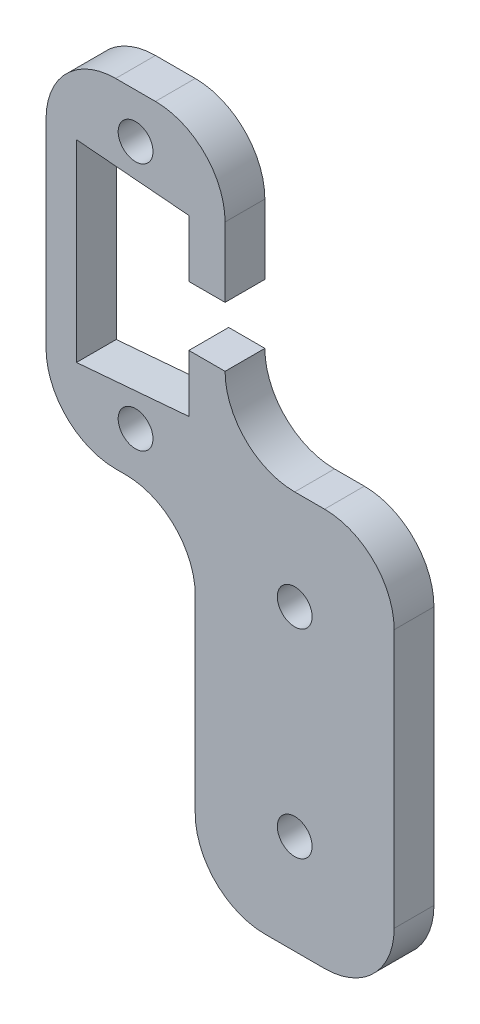
ISO-10303-21;
HEADER;
FILE_DESCRIPTION(('STEP AP214'),'2;1');
FILE_NAME('part.step','',(''),(''),'','','');
FILE_SCHEMA(('AUTOMOTIVE_DESIGN { 1 0 10303 214 1 1 1 1 }'));
ENDSEC;
DATA;
#1=APPLICATION_CONTEXT('core data for automotive mechanical design processes');
#2=APPLICATION_PROTOCOL_DEFINITION('international standard','automotive_design',2000,#1);
#3=PRODUCT_CONTEXT('',#1,'mechanical');
#4=PRODUCT('Part','Part','',(#3));
#5=PRODUCT_RELATED_PRODUCT_CATEGORY('part','',(#4));
#6=PRODUCT_DEFINITION_FORMATION('','',#4);
#7=PRODUCT_DEFINITION_CONTEXT('part definition',#1,'design');
#8=PRODUCT_DEFINITION('design','',#6,#7);
#9=PRODUCT_DEFINITION_SHAPE('','',#8);
#10=(LENGTH_UNIT() NAMED_UNIT(*) SI_UNIT(.MILLI.,.METRE.));
#11=(NAMED_UNIT(*) PLANE_ANGLE_UNIT() SI_UNIT($,.RADIAN.));
#12=(NAMED_UNIT(*) SI_UNIT($,.STERADIAN.) SOLID_ANGLE_UNIT());
#13=UNCERTAINTY_MEASURE_WITH_UNIT(LENGTH_MEASURE(1.E-05),#10,'distance_accuracy_value','');
#14=(GEOMETRIC_REPRESENTATION_CONTEXT(3) GLOBAL_UNCERTAINTY_ASSIGNED_CONTEXT((#13)) GLOBAL_UNIT_ASSIGNED_CONTEXT((#10,
#11,#12)) REPRESENTATION_CONTEXT('',''));
#15=CARTESIAN_POINT('',(0.,0.,0.));
#16=DIRECTION('',(0.,0.,1.));
#17=DIRECTION('',(1.,0.,0.));
#18=AXIS2_PLACEMENT_3D('',#15,#16,#17);
#19=CARTESIAN_POINT('',(0.,0.,4.));
#20=DIRECTION('',(0.,0.,1.));
#21=DIRECTION('',(1.,0.,0.));
#22=AXIS2_PLACEMENT_3D('',#19,#20,#21);
#23=PLANE('',#22);
#24=CARTESIAN_POINT('',(0.,12.5,4.));
#25=DIRECTION('',(0.,0.,1.));
#26=DIRECTION('',(1.,0.,0.));
#27=AXIS2_PLACEMENT_3D('',#24,#25,#26);
#28=CIRCLE('',#27,1.75);
#29=CARTESIAN_POINT('',(1.75,12.5,4.));
#30=VERTEX_POINT('',#29);
#31=EDGE_CURVE('E722',#30,#30,#28,.T.);
#32=ORIENTED_EDGE('',*,*,#31,.F.);
#33=EDGE_LOOP('',(#32));
#34=FACE_BOUND('',#33,.T.);
#35=CARTESIAN_POINT('',(16.,-40.,4.));
#36=DIRECTION('',(0.,0.,1.));
#37=DIRECTION('',(1.,0.,0.));
#38=AXIS2_PLACEMENT_3D('',#35,#36,#37);
#39=CIRCLE('',#38,1.75);
#40=CARTESIAN_POINT('',(17.75,-40.,4.));
#41=VERTEX_POINT('',#40);
#42=EDGE_CURVE('E380',#41,#41,#39,.T.);
#43=ORIENTED_EDGE('',*,*,#42,.F.);
#44=EDGE_LOOP('',(#43));
#45=FACE_BOUND('',#44,.T.);
#46=DIRECTION('',(0.,1.,0.));
#47=VECTOR('',#46,1.);
#48=CARTESIAN_POINT('',(9.,3.,4.));
#49=LINE('',#48,#47);
#50=CARTESIAN_POINT('',(9.,3.,4.));
#51=VERTEX_POINT('',#50);
#52=CARTESIAN_POINT('',(9.,10.,4.));
#53=VERTEX_POINT('',#52);
#54=EDGE_CURVE('E369',#51,#53,#49,.T.);
#55=ORIENTED_EDGE('',*,*,#54,.T.);
#56=CARTESIAN_POINT('',(2.,10.,4.));
#57=DIRECTION('',(0.,0.,1.));
#58=DIRECTION('',(1.,0.,0.));
#59=AXIS2_PLACEMENT_3D('',#56,#57,#58);
#60=CIRCLE('',#59,7.);
#61=CARTESIAN_POINT('',(2.,17.,4.));
#62=VERTEX_POINT('',#61);
#63=EDGE_CURVE('E243',#53,#62,#60,.T.);
#64=ORIENTED_EDGE('',*,*,#63,.T.);
#65=DIRECTION('',(-1.,0.,0.));
#66=VECTOR('',#65,1.);
#67=CARTESIAN_POINT('',(-9.,17.,4.));
#68=LINE('',#67,#66);
#69=CARTESIAN_POINT('',(-2.,17.,4.));
#70=VERTEX_POINT('',#69);
#71=EDGE_CURVE('E371',#62,#70,#68,.T.);
#72=ORIENTED_EDGE('',*,*,#71,.T.);
#73=CARTESIAN_POINT('',(-2.,10.,4.));
#74=DIRECTION('',(0.,0.,1.));
#75=DIRECTION('',(1.,0.,0.));
#76=AXIS2_PLACEMENT_3D('',#73,#74,#75);
#77=CIRCLE('',#76,7.);
#78=CARTESIAN_POINT('',(-9.,10.,4.));
#79=VERTEX_POINT('',#78);
#80=EDGE_CURVE('E233',#70,#79,#77,.T.);
#81=ORIENTED_EDGE('',*,*,#80,.T.);
#82=DIRECTION('',(0.,-1.,0.));
#83=VECTOR('',#82,1.);
#84=CARTESIAN_POINT('',(-9.,17.,4.));
#85=LINE('',#84,#83);
#86=CARTESIAN_POINT('',(-9.,-10.,4.));
#87=VERTEX_POINT('',#86);
#88=EDGE_CURVE('E374',#79,#87,#85,.T.);
#89=ORIENTED_EDGE('',*,*,#88,.T.);
#90=CARTESIAN_POINT('',(-2.,-10.,4.));
#91=DIRECTION('',(0.,0.,1.));
#92=DIRECTION('',(1.,0.,0.));
#93=AXIS2_PLACEMENT_3D('',#90,#91,#92);
#94=CIRCLE('',#93,7.);
#95=CARTESIAN_POINT('',(-2.,-17.,4.));
#96=VERTEX_POINT('',#95);
#97=EDGE_CURVE('E241',#87,#96,#94,.T.);
#98=ORIENTED_EDGE('',*,*,#97,.T.);
#99=DIRECTION('',(1.,0.,0.));
#100=VECTOR('',#99,1.);
#101=CARTESIAN_POINT('',(-9.,-17.,4.));
#102=LINE('',#101,#100);
#103=CARTESIAN_POINT('',(-1.,-17.,4.));
#104=VERTEX_POINT('',#103);
#105=EDGE_CURVE('E377',#96,#104,#102,.T.);
#106=ORIENTED_EDGE('',*,*,#105,.T.);
#107=CARTESIAN_POINT('',(-1.,-24.,4.));
#108=DIRECTION('',(0.,0.,1.));
#109=DIRECTION('',(1.,0.,0.));
#110=AXIS2_PLACEMENT_3D('',#107,#108,#109);
#111=CIRCLE('',#110,7.);
#112=CARTESIAN_POINT('',(6.,-24.,4.));
#113=VERTEX_POINT('',#112);
#114=EDGE_CURVE('E55',#104,#113,#111,.F.);
#115=ORIENTED_EDGE('',*,*,#114,.T.);
#116=DIRECTION('',(0.,-1.,0.));
#117=VECTOR('',#116,1.);
#118=CARTESIAN_POINT('',(6.,-17.,4.));
#119=LINE('',#118,#117);
#120=CARTESIAN_POINT('',(6.,-43.,4.));
#121=VERTEX_POINT('',#120);
#122=EDGE_CURVE('E327',#113,#121,#119,.T.);
#123=ORIENTED_EDGE('',*,*,#122,.T.);
#124=CARTESIAN_POINT('',(13.,-43.,4.));
#125=DIRECTION('',(0.,0.,1.));
#126=DIRECTION('',(1.,0.,0.));
#127=AXIS2_PLACEMENT_3D('',#124,#125,#126);
#128=CIRCLE('',#127,7.);
#129=CARTESIAN_POINT('',(13.,-50.,4.));
#130=VERTEX_POINT('',#129);
#131=EDGE_CURVE('E237',#121,#130,#128,.T.);
#132=ORIENTED_EDGE('',*,*,#131,.T.);
#133=DIRECTION('',(1.,0.,0.));
#134=VECTOR('',#133,1.);
#135=CARTESIAN_POINT('',(6.,-50.,4.));
#136=LINE('',#135,#134);
#137=CARTESIAN_POINT('',(19.,-50.,4.));
#138=VERTEX_POINT('',#137);
#139=EDGE_CURVE('E322',#130,#138,#136,.T.);
#140=ORIENTED_EDGE('',*,*,#139,.T.);
#141=CARTESIAN_POINT('',(19.,-43.,4.));
#142=DIRECTION('',(0.,0.,1.));
#143=DIRECTION('',(1.,0.,0.));
#144=AXIS2_PLACEMENT_3D('',#141,#142,#143);
#145=CIRCLE('',#144,7.);
#146=CARTESIAN_POINT('',(26.,-43.,4.));
#147=VERTEX_POINT('',#146);
#148=EDGE_CURVE('E235',#138,#147,#145,.T.);
#149=ORIENTED_EDGE('',*,*,#148,.T.);
#150=DIRECTION('',(0.,1.,0.));
#151=VECTOR('',#150,1.);
#152=CARTESIAN_POINT('',(26.,-50.,4.));
#153=LINE('',#152,#151);
#154=CARTESIAN_POINT('',(26.,-17.,4.));
#155=VERTEX_POINT('',#154);
#156=EDGE_CURVE('E398',#147,#155,#153,.T.);
#157=ORIENTED_EDGE('',*,*,#156,.T.);
#158=CARTESIAN_POINT('',(19.,-17.,4.));
#159=DIRECTION('',(0.,0.,1.));
#160=DIRECTION('',(1.,0.,0.));
#161=AXIS2_PLACEMENT_3D('',#158,#159,#160);
#162=CIRCLE('',#161,7.);
#163=CARTESIAN_POINT('',(19.,-10.,4.));
#164=VERTEX_POINT('',#163);
#165=EDGE_CURVE('E239',#155,#164,#162,.T.);
#166=ORIENTED_EDGE('',*,*,#165,.T.);
#167=DIRECTION('',(-1.,0.,0.));
#168=VECTOR('',#167,1.);
#169=CARTESIAN_POINT('',(26.,-10.,4.));
#170=LINE('',#169,#168);
#171=CARTESIAN_POINT('',(16.,-10.,4.));
#172=VERTEX_POINT('',#171);
#173=EDGE_CURVE('E194',#164,#172,#170,.T.);
#174=ORIENTED_EDGE('',*,*,#173,.T.);
#175=CARTESIAN_POINT('',(16.,-3.,4.));
#176=DIRECTION('',(0.,0.,1.));
#177=DIRECTION('',(1.,0.,0.));
#178=AXIS2_PLACEMENT_3D('',#175,#176,#177);
#179=CIRCLE('',#178,7.);
#180=CARTESIAN_POINT('',(9.,-3.,4.));
#181=VERTEX_POINT('',#180);
#182=EDGE_CURVE('E11',#172,#181,#179,.F.);
#183=ORIENTED_EDGE('',*,*,#182,.T.);
#184=DIRECTION('',(-1.,0.,0.));
#185=VECTOR('',#184,1.);
#186=CARTESIAN_POINT('',(5.35907859078591,-3.,4.));
#187=LINE('',#186,#185);
#188=CARTESIAN_POINT('',(5.35907859078591,-3.,4.));
#189=VERTEX_POINT('',#188);
#190=EDGE_CURVE('E191',#181,#189,#187,.T.);
#191=ORIENTED_EDGE('',*,*,#190,.T.);
#192=DIRECTION('',(0.,-1.,0.));
#193=VECTOR('',#192,1.);
#194=CARTESIAN_POINT('',(5.35907859078591,-3.,4.));
#195=LINE('',#194,#193);
#196=CARTESIAN_POINT('',(5.35907859078591,-8.74999999999999,4.));
#197=VERTEX_POINT('',#196);
#198=EDGE_CURVE('E206',#189,#197,#195,.T.);
#199=ORIENTED_EDGE('',*,*,#198,.T.);
#200=DIRECTION('',(-0.996484674130013,-0.0837752602144707,0.));
#201=VECTOR('',#200,1.);
#202=CARTESIAN_POINT('',(-5.94092140921409,-9.7,4.));
#203=LINE('',#202,#201);
#204=CARTESIAN_POINT('',(-5.94092140921409,-9.7,4.));
#205=VERTEX_POINT('',#204);
#206=EDGE_CURVE('E345',#197,#205,#203,.T.);
#207=ORIENTED_EDGE('',*,*,#206,.T.);
#208=DIRECTION('',(0.,1.,0.));
#209=VECTOR('',#208,1.);
#210=CARTESIAN_POINT('',(-5.94092140921409,9.7,4.));
#211=LINE('',#210,#209);
#212=CARTESIAN_POINT('',(-5.94092140921409,9.7,4.));
#213=VERTEX_POINT('',#212);
#214=EDGE_CURVE('E361',#205,#213,#211,.T.);
#215=ORIENTED_EDGE('',*,*,#214,.T.);
#216=DIRECTION('',(0.996484674130013,-0.0837752602144707,0.));
#217=VECTOR('',#216,1.);
#218=CARTESIAN_POINT('',(-5.94092140921409,9.7,4.));
#219=LINE('',#218,#217);
#220=CARTESIAN_POINT('',(5.35907859078591,8.74999999999999,4.));
#221=VERTEX_POINT('',#220);
#222=EDGE_CURVE('E358',#213,#221,#219,.T.);
#223=ORIENTED_EDGE('',*,*,#222,.T.);
#224=DIRECTION('',(0.,-1.,0.));
#225=VECTOR('',#224,1.);
#226=CARTESIAN_POINT('',(5.35907859078591,8.74999999999999,4.));
#227=LINE('',#226,#225);
#228=CARTESIAN_POINT('',(5.35907859078591,3.,4.));
#229=VERTEX_POINT('',#228);
#230=EDGE_CURVE('E360',#221,#229,#227,.T.);
#231=ORIENTED_EDGE('',*,*,#230,.T.);
#232=DIRECTION('',(1.,0.,0.));
#233=VECTOR('',#232,1.);
#234=CARTESIAN_POINT('',(5.35907859078591,3.,4.));
#235=LINE('',#234,#233);
#236=EDGE_CURVE('E363',#229,#51,#235,.T.);
#237=ORIENTED_EDGE('',*,*,#236,.T.);
#238=EDGE_LOOP('',(#55,#64,#72,#81,#89,#98,#106,#115,#123,#132,#140,#149,#157,#166,#174,#183,
#191,#199,#207,#215,#223,#231,#237));
#239=FACE_BOUND('',#238,.T.);
#240=CARTESIAN_POINT('',(16.,-20.,4.));
#241=DIRECTION('',(0.,0.,1.));
#242=DIRECTION('',(1.,0.,0.));
#243=AXIS2_PLACEMENT_3D('',#240,#241,#242);
#244=CIRCLE('',#243,1.75);
#245=CARTESIAN_POINT('',(17.75,-20.,4.));
#246=VERTEX_POINT('',#245);
#247=EDGE_CURVE('E390',#246,#246,#244,.T.);
#248=ORIENTED_EDGE('',*,*,#247,.F.);
#249=EDGE_LOOP('',(#248));
#250=FACE_BOUND('',#249,.T.);
#251=CARTESIAN_POINT('',(0.,-12.5,4.));
#252=DIRECTION('',(0.,0.,1.));
#253=DIRECTION('',(1.,0.,0.));
#254=AXIS2_PLACEMENT_3D('',#251,#252,#253);
#255=CIRCLE('',#254,1.75);
#256=CARTESIAN_POINT('',(1.75,-12.5,4.));
#257=VERTEX_POINT('',#256);
#258=EDGE_CURVE('E713',#257,#257,#255,.T.);
#259=ORIENTED_EDGE('',*,*,#258,.F.);
#260=EDGE_LOOP('',(#259));
#261=FACE_BOUND('',#260,.T.);
#262=ADVANCED_FACE('F33',(#34,#45,#239,#250,#261),#23,.T.);
#263=CARTESIAN_POINT('',(0.,0.,0.));
#264=DIRECTION('',(0.,0.,1.));
#265=DIRECTION('',(1.,0.,0.));
#266=AXIS2_PLACEMENT_3D('',#263,#264,#265);
#267=PLANE('',#266);
#268=DIRECTION('',(-1.,0.,0.));
#269=VECTOR('',#268,1.);
#270=CARTESIAN_POINT('',(-9.,17.,0.));
#271=LINE('',#270,#269);
#272=CARTESIAN_POINT('',(2.,17.,0.));
#273=VERTEX_POINT('',#272);
#274=CARTESIAN_POINT('',(-2.,17.,0.));
#275=VERTEX_POINT('',#274);
#276=EDGE_CURVE('E311',#273,#275,#271,.T.);
#277=ORIENTED_EDGE('',*,*,#276,.F.);
#278=CARTESIAN_POINT('',(2.,10.,0.));
#279=DIRECTION('',(0.,0.,1.));
#280=DIRECTION('',(1.,0.,0.));
#281=AXIS2_PLACEMENT_3D('',#278,#279,#280);
#282=CIRCLE('',#281,7.);
#283=CARTESIAN_POINT('',(9.,10.,0.));
#284=VERTEX_POINT('',#283);
#285=EDGE_CURVE('E229',#273,#284,#282,.F.);
#286=ORIENTED_EDGE('',*,*,#285,.T.);
#287=DIRECTION('',(0.,1.,0.));
#288=VECTOR('',#287,1.);
#289=CARTESIAN_POINT('',(9.,3.,0.));
#290=LINE('',#289,#288);
#291=CARTESIAN_POINT('',(9.,3.,0.));
#292=VERTEX_POINT('',#291);
#293=EDGE_CURVE('E308',#292,#284,#290,.T.);
#294=ORIENTED_EDGE('',*,*,#293,.F.);
#295=DIRECTION('',(1.,0.,0.));
#296=VECTOR('',#295,1.);
#297=CARTESIAN_POINT('',(5.35907859078591,3.,0.));
#298=LINE('',#297,#296);
#299=CARTESIAN_POINT('',(5.35907859078591,3.,0.));
#300=VERTEX_POINT('',#299);
#301=EDGE_CURVE('E306',#300,#292,#298,.T.);
#302=ORIENTED_EDGE('',*,*,#301,.F.);
#303=DIRECTION('',(0.,-1.,0.));
#304=VECTOR('',#303,1.);
#305=CARTESIAN_POINT('',(5.35907859078591,8.74999999999999,0.));
#306=LINE('',#305,#304);
#307=CARTESIAN_POINT('',(5.35907859078591,8.74999999999999,0.));
#308=VERTEX_POINT('',#307);
#309=EDGE_CURVE('E304',#308,#300,#306,.T.);
#310=ORIENTED_EDGE('',*,*,#309,.F.);
#311=DIRECTION('',(0.996484674130013,-0.0837752602144707,0.));
#312=VECTOR('',#311,1.);
#313=CARTESIAN_POINT('',(-5.94092140921409,9.7,0.));
#314=LINE('',#313,#312);
#315=CARTESIAN_POINT('',(-5.94092140921409,9.7,0.));
#316=VERTEX_POINT('',#315);
#317=EDGE_CURVE('E302',#316,#308,#314,.T.);
#318=ORIENTED_EDGE('',*,*,#317,.F.);
#319=DIRECTION('',(0.,1.,0.));
#320=VECTOR('',#319,1.);
#321=CARTESIAN_POINT('',(-5.94092140921409,9.7,0.));
#322=LINE('',#321,#320);
#323=CARTESIAN_POINT('',(-5.94092140921409,-9.7,0.));
#324=VERTEX_POINT('',#323);
#325=EDGE_CURVE('E300',#324,#316,#322,.T.);
#326=ORIENTED_EDGE('',*,*,#325,.F.);
#327=DIRECTION('',(-0.996484674130013,-0.0837752602144707,0.));
#328=VECTOR('',#327,1.);
#329=CARTESIAN_POINT('',(-5.94092140921409,-9.7,0.));
#330=LINE('',#329,#328);
#331=CARTESIAN_POINT('',(5.35907859078591,-8.74999999999999,0.));
#332=VERTEX_POINT('',#331);
#333=EDGE_CURVE('E298',#332,#324,#330,.T.);
#334=ORIENTED_EDGE('',*,*,#333,.F.);
#335=DIRECTION('',(0.,-1.,0.));
#336=VECTOR('',#335,1.);
#337=CARTESIAN_POINT('',(5.35907859078591,-3.,0.));
#338=LINE('',#337,#336);
#339=CARTESIAN_POINT('',(5.35907859078591,-3.,0.));
#340=VERTEX_POINT('',#339);
#341=EDGE_CURVE('E290',#340,#332,#338,.T.);
#342=ORIENTED_EDGE('',*,*,#341,.F.);
#343=DIRECTION('',(-1.,0.,0.));
#344=VECTOR('',#343,1.);
#345=CARTESIAN_POINT('',(5.35907859078591,-3.,0.));
#346=LINE('',#345,#344);
#347=CARTESIAN_POINT('',(9.,-3.,0.));
#348=VERTEX_POINT('',#347);
#349=EDGE_CURVE('E284',#348,#340,#346,.T.);
#350=ORIENTED_EDGE('',*,*,#349,.F.);
#351=CARTESIAN_POINT('',(16.,-3.,0.));
#352=DIRECTION('',(0.,0.,1.));
#353=DIRECTION('',(1.,0.,0.));
#354=AXIS2_PLACEMENT_3D('',#351,#352,#353);
#355=CIRCLE('',#354,7.);
#356=CARTESIAN_POINT('',(16.,-10.,0.));
#357=VERTEX_POINT('',#356);
#358=EDGE_CURVE('E41',#348,#357,#355,.T.);
#359=ORIENTED_EDGE('',*,*,#358,.T.);
#360=DIRECTION('',(-1.,0.,0.));
#361=VECTOR('',#360,1.);
#362=CARTESIAN_POINT('',(26.,-10.,0.));
#363=LINE('',#362,#361);
#364=CARTESIAN_POINT('',(19.,-10.,0.));
#365=VERTEX_POINT('',#364);
#366=EDGE_CURVE('E282',#365,#357,#363,.T.);
#367=ORIENTED_EDGE('',*,*,#366,.F.);
#368=CARTESIAN_POINT('',(19.,-17.,0.));
#369=DIRECTION('',(0.,0.,1.));
#370=DIRECTION('',(1.,0.,0.));
#371=AXIS2_PLACEMENT_3D('',#368,#369,#370);
#372=CIRCLE('',#371,7.);
#373=CARTESIAN_POINT('',(26.,-17.,0.));
#374=VERTEX_POINT('',#373);
#375=EDGE_CURVE('E225',#365,#374,#372,.F.);
#376=ORIENTED_EDGE('',*,*,#375,.T.);
#377=DIRECTION('',(0.,1.,0.));
#378=VECTOR('',#377,1.);
#379=CARTESIAN_POINT('',(26.,-50.,0.));
#380=LINE('',#379,#378);
#381=CARTESIAN_POINT('',(26.,-43.,0.));
#382=VERTEX_POINT('',#381);
#383=EDGE_CURVE('E288',#382,#374,#380,.T.);
#384=ORIENTED_EDGE('',*,*,#383,.F.);
#385=CARTESIAN_POINT('',(19.,-43.,0.));
#386=DIRECTION('',(0.,0.,1.));
#387=DIRECTION('',(1.,0.,0.));
#388=AXIS2_PLACEMENT_3D('',#385,#386,#387);
#389=CIRCLE('',#388,7.);
#390=CARTESIAN_POINT('',(19.,-50.,0.));
#391=VERTEX_POINT('',#390);
#392=EDGE_CURVE('E221',#382,#391,#389,.F.);
#393=ORIENTED_EDGE('',*,*,#392,.T.);
#394=DIRECTION('',(1.,0.,0.));
#395=VECTOR('',#394,1.);
#396=CARTESIAN_POINT('',(6.,-50.,0.));
#397=LINE('',#396,#395);
#398=CARTESIAN_POINT('',(13.,-50.,0.));
#399=VERTEX_POINT('',#398);
#400=EDGE_CURVE('E293',#399,#391,#397,.T.);
#401=ORIENTED_EDGE('',*,*,#400,.F.);
#402=CARTESIAN_POINT('',(13.,-43.,0.));
#403=DIRECTION('',(0.,0.,1.));
#404=DIRECTION('',(1.,0.,0.));
#405=AXIS2_PLACEMENT_3D('',#402,#403,#404);
#406=CIRCLE('',#405,7.);
#407=CARTESIAN_POINT('',(6.,-43.,0.));
#408=VERTEX_POINT('',#407);
#409=EDGE_CURVE('E223',#399,#408,#406,.F.);
#410=ORIENTED_EDGE('',*,*,#409,.T.);
#411=DIRECTION('',(0.,-1.,0.));
#412=VECTOR('',#411,1.);
#413=CARTESIAN_POINT('',(6.,-17.,0.));
#414=LINE('',#413,#412);
#415=CARTESIAN_POINT('',(6.,-24.,0.));
#416=VERTEX_POINT('',#415);
#417=EDGE_CURVE('E320',#416,#408,#414,.T.);
#418=ORIENTED_EDGE('',*,*,#417,.F.);
#419=CARTESIAN_POINT('',(-1.,-24.,0.));
#420=DIRECTION('',(0.,0.,1.));
#421=DIRECTION('',(1.,0.,0.));
#422=AXIS2_PLACEMENT_3D('',#419,#420,#421);
#423=CIRCLE('',#422,7.);
#424=CARTESIAN_POINT('',(-1.,-17.,0.));
#425=VERTEX_POINT('',#424);
#426=EDGE_CURVE('E274',#416,#425,#423,.T.);
#427=ORIENTED_EDGE('',*,*,#426,.T.);
#428=DIRECTION('',(1.,0.,0.));
#429=VECTOR('',#428,1.);
#430=CARTESIAN_POINT('',(-9.,-17.,0.));
#431=LINE('',#430,#429);
#432=CARTESIAN_POINT('',(-2.,-17.,0.));
#433=VERTEX_POINT('',#432);
#434=EDGE_CURVE('E317',#433,#425,#431,.T.);
#435=ORIENTED_EDGE('',*,*,#434,.F.);
#436=CARTESIAN_POINT('',(-2.,-10.,0.));
#437=DIRECTION('',(0.,0.,1.));
#438=DIRECTION('',(1.,0.,0.));
#439=AXIS2_PLACEMENT_3D('',#436,#437,#438);
#440=CIRCLE('',#439,7.);
#441=CARTESIAN_POINT('',(-9.,-10.,0.));
#442=VERTEX_POINT('',#441);
#443=EDGE_CURVE('E227',#433,#442,#440,.F.);
#444=ORIENTED_EDGE('',*,*,#443,.T.);
#445=DIRECTION('',(0.,-1.,0.));
#446=VECTOR('',#445,1.);
#447=CARTESIAN_POINT('',(-9.,17.,0.));
#448=LINE('',#447,#446);
#449=CARTESIAN_POINT('',(-9.,10.,0.));
#450=VERTEX_POINT('',#449);
#451=EDGE_CURVE('E314',#450,#442,#448,.T.);
#452=ORIENTED_EDGE('',*,*,#451,.F.);
#453=CARTESIAN_POINT('',(-2.,10.,0.));
#454=DIRECTION('',(0.,0.,1.));
#455=DIRECTION('',(1.,0.,0.));
#456=AXIS2_PLACEMENT_3D('',#453,#454,#455);
#457=CIRCLE('',#456,7.);
#458=EDGE_CURVE('E219',#450,#275,#457,.F.);
#459=ORIENTED_EDGE('',*,*,#458,.T.);
#460=EDGE_LOOP('',(#277,#286,#294,#302,#310,#318,#326,#334,#342,#350,#359,#367,#376,#384,#393,
#401,#410,#418,#427,#435,#444,#452,#459));
#461=FACE_BOUND('',#460,.T.);
#462=CARTESIAN_POINT('',(16.,-40.,0.));
#463=DIRECTION('',(0.,0.,1.));
#464=DIRECTION('',(1.,0.,0.));
#465=AXIS2_PLACEMENT_3D('',#462,#463,#464);
#466=CIRCLE('',#465,1.75);
#467=CARTESIAN_POINT('',(17.75,-40.,0.));
#468=VERTEX_POINT('',#467);
#469=EDGE_CURVE('E385',#468,#468,#466,.T.);
#470=ORIENTED_EDGE('',*,*,#469,.T.);
#471=EDGE_LOOP('',(#470));
#472=FACE_BOUND('',#471,.T.);
#473=CARTESIAN_POINT('',(16.,-20.,0.));
#474=DIRECTION('',(0.,0.,1.));
#475=DIRECTION('',(1.,0.,0.));
#476=AXIS2_PLACEMENT_3D('',#473,#474,#475);
#477=CIRCLE('',#476,1.75);
#478=CARTESIAN_POINT('',(17.75,-20.,0.));
#479=VERTEX_POINT('',#478);
#480=EDGE_CURVE('E393',#479,#479,#477,.T.);
#481=ORIENTED_EDGE('',*,*,#480,.T.);
#482=EDGE_LOOP('',(#481));
#483=FACE_BOUND('',#482,.T.);
#484=CARTESIAN_POINT('',(0.,12.5,0.));
#485=DIRECTION('',(0.,0.,1.));
#486=DIRECTION('',(1.,0.,0.));
#487=AXIS2_PLACEMENT_3D('',#484,#485,#486);
#488=CIRCLE('',#487,1.75);
#489=CARTESIAN_POINT('',(1.75,12.5,0.));
#490=VERTEX_POINT('',#489);
#491=EDGE_CURVE('E719',#490,#490,#488,.T.);
#492=ORIENTED_EDGE('',*,*,#491,.T.);
#493=EDGE_LOOP('',(#492));
#494=FACE_BOUND('',#493,.T.);
#495=CARTESIAN_POINT('',(0.,-12.5,0.));
#496=DIRECTION('',(0.,0.,1.));
#497=DIRECTION('',(1.,0.,0.));
#498=AXIS2_PLACEMENT_3D('',#495,#496,#497);
#499=CIRCLE('',#498,1.75);
#500=CARTESIAN_POINT('',(1.75,-12.5,0.));
#501=VERTEX_POINT('',#500);
#502=EDGE_CURVE('E716',#501,#501,#499,.T.);
#503=ORIENTED_EDGE('',*,*,#502,.T.);
#504=EDGE_LOOP('',(#503));
#505=FACE_BOUND('',#504,.T.);
#506=ADVANCED_FACE('F280',(#461,#472,#483,#494,#505),#267,.F.);
#507=CARTESIAN_POINT('',(6.,-50.,4.));
#508=DIRECTION('',(0.,1.,0.));
#509=DIRECTION('',(-1.,0.,0.));
#510=AXIS2_PLACEMENT_3D('',#507,#508,#509);
#511=PLANE('',#510);
#512=ORIENTED_EDGE('',*,*,#139,.F.);
#513=DIRECTION('',(0.,0.,-1.));
#514=VECTOR('',#513,1.);
#515=CARTESIAN_POINT('',(13.,-50.,4.));
#516=LINE('',#515,#514);
#517=EDGE_CURVE('E271',#130,#399,#516,.T.);
#518=ORIENTED_EDGE('',*,*,#517,.T.);
#519=ORIENTED_EDGE('',*,*,#400,.T.);
#520=DIRECTION('',(0.,0.,-1.));
#521=VECTOR('',#520,1.);
#522=CARTESIAN_POINT('',(19.,-50.,4.));
#523=LINE('',#522,#521);
#524=EDGE_CURVE('E269',#391,#138,#523,.F.);
#525=ORIENTED_EDGE('',*,*,#524,.T.);
#526=EDGE_LOOP('',(#512,#518,#519,#525));
#527=FACE_BOUND('',#526,.T.);
#528=ADVANCED_FACE('F417',(#527),#511,.F.);
#529=CARTESIAN_POINT('',(26.,-50.,4.));
#530=DIRECTION('',(-1.,0.,0.));
#531=DIRECTION('',(0.,0.,1.));
#532=AXIS2_PLACEMENT_3D('',#529,#530,#531);
#533=PLANE('',#532);
#534=ORIENTED_EDGE('',*,*,#383,.T.);
#535=DIRECTION('',(0.,0.,-1.));
#536=VECTOR('',#535,1.);
#537=CARTESIAN_POINT('',(26.,-17.,4.));
#538=LINE('',#537,#536);
#539=EDGE_CURVE('E267',#374,#155,#538,.F.);
#540=ORIENTED_EDGE('',*,*,#539,.T.);
#541=ORIENTED_EDGE('',*,*,#156,.F.);
#542=DIRECTION('',(0.,0.,-1.));
#543=VECTOR('',#542,1.);
#544=CARTESIAN_POINT('',(26.,-43.,4.));
#545=LINE('',#544,#543);
#546=EDGE_CURVE('E264',#147,#382,#545,.T.);
#547=ORIENTED_EDGE('',*,*,#546,.T.);
#548=EDGE_LOOP('',(#534,#540,#541,#547));
#549=FACE_BOUND('',#548,.T.);
#550=ADVANCED_FACE('F641',(#549),#533,.F.);
#551=CARTESIAN_POINT('',(26.,-10.,4.));
#552=DIRECTION('',(0.,-1.,0.));
#553=DIRECTION('',(1.,0.,0.));
#554=AXIS2_PLACEMENT_3D('',#551,#552,#553);
#555=PLANE('',#554);
#556=ORIENTED_EDGE('',*,*,#173,.F.);
#557=DIRECTION('',(0.,0.,-1.));
#558=VECTOR('',#557,1.);
#559=CARTESIAN_POINT('',(19.,-10.,4.));
#560=LINE('',#559,#558);
#561=EDGE_CURVE('E261',#164,#365,#560,.T.);
#562=ORIENTED_EDGE('',*,*,#561,.T.);
#563=ORIENTED_EDGE('',*,*,#366,.T.);
#564=DIRECTION('',(0.,0.,-1.));
#565=VECTOR('',#564,1.);
#566=CARTESIAN_POINT('',(16.,-10.,4.));
#567=LINE('',#566,#565);
#568=EDGE_CURVE('E259',#357,#172,#567,.F.);
#569=ORIENTED_EDGE('',*,*,#568,.T.);
#570=EDGE_LOOP('',(#556,#562,#563,#569));
#571=FACE_BOUND('',#570,.T.);
#572=ADVANCED_FACE('F286',(#571),#555,.F.);
#573=CARTESIAN_POINT('',(5.35907859078591,-3.,4.));
#574=DIRECTION('',(0.,-1.,0.));
#575=DIRECTION('',(0.,0.,-1.));
#576=AXIS2_PLACEMENT_3D('',#573,#574,#575);
#577=PLANE('',#576);
#578=ORIENTED_EDGE('',*,*,#349,.T.);
#579=DIRECTION('',(0.,0.,-1.));
#580=VECTOR('',#579,1.);
#581=CARTESIAN_POINT('',(5.35907859078591,-3.,4.));
#582=LINE('',#581,#580);
#583=EDGE_CURVE('E204',#189,#340,#582,.T.);
#584=ORIENTED_EDGE('',*,*,#583,.F.);
#585=ORIENTED_EDGE('',*,*,#190,.F.);
#586=DIRECTION('',(0.,0.,-1.));
#587=VECTOR('',#586,1.);
#588=CARTESIAN_POINT('',(9.,-3.,4.));
#589=LINE('',#588,#587);
#590=EDGE_CURVE('E201',#181,#348,#589,.T.);
#591=ORIENTED_EDGE('',*,*,#590,.T.);
#592=EDGE_LOOP('',(#578,#584,#585,#591));
#593=FACE_BOUND('',#592,.T.);
#594=ADVANCED_FACE('F200',(#593),#577,.F.);
#595=CARTESIAN_POINT('',(5.35907859078591,-3.,4.));
#596=DIRECTION('',(1.,0.,0.));
#597=DIRECTION('',(0.,0.,-1.));
#598=AXIS2_PLACEMENT_3D('',#595,#596,#597);
#599=PLANE('',#598);
#600=ORIENTED_EDGE('',*,*,#341,.T.);
#601=DIRECTION('',(0.,0.,-1.));
#602=VECTOR('',#601,1.);
#603=CARTESIAN_POINT('',(5.35907859078591,-8.74999999999999,4.));
#604=LINE('',#603,#602);
#605=EDGE_CURVE('E213',#197,#332,#604,.T.);
#606=ORIENTED_EDGE('',*,*,#605,.F.);
#607=ORIENTED_EDGE('',*,*,#198,.F.);
#608=ORIENTED_EDGE('',*,*,#583,.T.);
#609=EDGE_LOOP('',(#600,#606,#607,#608));
#610=FACE_BOUND('',#609,.T.);
#611=ADVANCED_FACE('F402',(#610),#599,.F.);
#612=CARTESIAN_POINT('',(-5.94092140921409,-9.7,4.));
#613=DIRECTION('',(0.0837752602144707,-0.996484674130013,0.));
#614=DIRECTION('',(0.996484674130013,0.0837752602144707,0.));
#615=AXIS2_PLACEMENT_3D('',#612,#613,#614);
#616=PLANE('',#615);
#617=ORIENTED_EDGE('',*,*,#333,.T.);
#618=DIRECTION('',(0.,0.,-1.));
#619=VECTOR('',#618,1.);
#620=CARTESIAN_POINT('',(-5.94092140921409,-9.7,4.));
#621=LINE('',#620,#619);
#622=EDGE_CURVE('E336',#205,#324,#621,.T.);
#623=ORIENTED_EDGE('',*,*,#622,.F.);
#624=ORIENTED_EDGE('',*,*,#206,.F.);
#625=ORIENTED_EDGE('',*,*,#605,.T.);
#626=EDGE_LOOP('',(#617,#623,#624,#625));
#627=FACE_BOUND('',#626,.T.);
#628=ADVANCED_FACE('F343',(#627),#616,.F.);
#629=CARTESIAN_POINT('',(-5.94092140921409,9.7,4.));
#630=DIRECTION('',(-1.,0.,0.));
#631=DIRECTION('',(0.,0.,1.));
#632=AXIS2_PLACEMENT_3D('',#629,#630,#631);
#633=PLANE('',#632);
#634=ORIENTED_EDGE('',*,*,#325,.T.);
#635=DIRECTION('',(0.,0.,-1.));
#636=VECTOR('',#635,1.);
#637=CARTESIAN_POINT('',(-5.94092140921409,9.7,4.));
#638=LINE('',#637,#636);
#639=EDGE_CURVE('E333',#213,#316,#638,.T.);
#640=ORIENTED_EDGE('',*,*,#639,.F.);
#641=ORIENTED_EDGE('',*,*,#214,.F.);
#642=ORIENTED_EDGE('',*,*,#622,.T.);
#643=EDGE_LOOP('',(#634,#640,#641,#642));
#644=FACE_BOUND('',#643,.T.);
#645=ADVANCED_FACE('F352',(#644),#633,.F.);
#646=CARTESIAN_POINT('',(-5.94092140921409,9.7,4.));
#647=DIRECTION('',(0.0837752602144707,0.996484674130013,0.));
#648=DIRECTION('',(-0.996484674130013,0.0837752602144707,0.));
#649=AXIS2_PLACEMENT_3D('',#646,#647,#648);
#650=PLANE('',#649);
#651=ORIENTED_EDGE('',*,*,#317,.T.);
#652=DIRECTION('',(0.,0.,-1.));
#653=VECTOR('',#652,1.);
#654=CARTESIAN_POINT('',(5.35907859078591,8.74999999999999,4.));
#655=LINE('',#654,#653);
#656=EDGE_CURVE('E330',#221,#308,#655,.T.);
#657=ORIENTED_EDGE('',*,*,#656,.F.);
#658=ORIENTED_EDGE('',*,*,#222,.F.);
#659=ORIENTED_EDGE('',*,*,#639,.T.);
#660=EDGE_LOOP('',(#651,#657,#658,#659));
#661=FACE_BOUND('',#660,.T.);
#662=ADVANCED_FACE('F356',(#661),#650,.F.);
#663=CARTESIAN_POINT('',(5.35907859078591,8.74999999999999,4.));
#664=DIRECTION('',(1.,0.,0.));
#665=DIRECTION('',(0.,0.,-1.));
#666=AXIS2_PLACEMENT_3D('',#663,#664,#665);
#667=PLANE('',#666);
#668=ORIENTED_EDGE('',*,*,#309,.T.);
#669=DIRECTION('',(0.,0.,-1.));
#670=VECTOR('',#669,1.);
#671=CARTESIAN_POINT('',(5.35907859078591,3.,4.));
#672=LINE('',#671,#670);
#673=EDGE_CURVE('E326',#229,#300,#672,.T.);
#674=ORIENTED_EDGE('',*,*,#673,.F.);
#675=ORIENTED_EDGE('',*,*,#230,.F.);
#676=ORIENTED_EDGE('',*,*,#656,.T.);
#677=EDGE_LOOP('',(#668,#674,#675,#676));
#678=FACE_BOUND('',#677,.T.);
#679=ADVANCED_FACE('F447',(#678),#667,.F.);
#680=CARTESIAN_POINT('',(5.35907859078591,3.,4.));
#681=DIRECTION('',(0.,1.,0.));
#682=DIRECTION('',(0.,0.,1.));
#683=AXIS2_PLACEMENT_3D('',#680,#681,#682);
#684=PLANE('',#683);
#685=ORIENTED_EDGE('',*,*,#301,.T.);
#686=DIRECTION('',(0.,0.,-1.));
#687=VECTOR('',#686,1.);
#688=CARTESIAN_POINT('',(9.,3.,4.));
#689=LINE('',#688,#687);
#690=EDGE_CURVE('E323',#51,#292,#689,.T.);
#691=ORIENTED_EDGE('',*,*,#690,.F.);
#692=ORIENTED_EDGE('',*,*,#236,.F.);
#693=ORIENTED_EDGE('',*,*,#673,.T.);
#694=EDGE_LOOP('',(#685,#691,#692,#693));
#695=FACE_BOUND('',#694,.T.);
#696=ADVANCED_FACE('F443',(#695),#684,.F.);
#697=CARTESIAN_POINT('',(9.,3.,4.));
#698=DIRECTION('',(-1.,0.,0.));
#699=DIRECTION('',(0.,0.,1.));
#700=AXIS2_PLACEMENT_3D('',#697,#698,#699);
#701=PLANE('',#700);
#702=ORIENTED_EDGE('',*,*,#293,.T.);
#703=DIRECTION('',(0.,0.,-1.));
#704=VECTOR('',#703,1.);
#705=CARTESIAN_POINT('',(9.,10.,4.));
#706=LINE('',#705,#704);
#707=EDGE_CURVE('E231',#284,#53,#706,.F.);
#708=ORIENTED_EDGE('',*,*,#707,.T.);
#709=ORIENTED_EDGE('',*,*,#54,.F.);
#710=ORIENTED_EDGE('',*,*,#690,.T.);
#711=EDGE_LOOP('',(#702,#708,#709,#710));
#712=FACE_BOUND('',#711,.T.);
#713=ADVANCED_FACE('F439',(#712),#701,.F.);
#714=CARTESIAN_POINT('',(-9.,17.,4.));
#715=DIRECTION('',(0.,-1.,0.));
#716=DIRECTION('',(0.,0.,-1.));
#717=AXIS2_PLACEMENT_3D('',#714,#715,#716);
#718=PLANE('',#717);
#719=ORIENTED_EDGE('',*,*,#71,.F.);
#720=DIRECTION('',(0.,0.,-1.));
#721=VECTOR('',#720,1.);
#722=CARTESIAN_POINT('',(2.,17.,4.));
#723=LINE('',#722,#721);
#724=EDGE_CURVE('E211',#62,#273,#723,.T.);
#725=ORIENTED_EDGE('',*,*,#724,.T.);
#726=ORIENTED_EDGE('',*,*,#276,.T.);
#727=DIRECTION('',(0.,0.,-1.));
#728=VECTOR('',#727,1.);
#729=CARTESIAN_POINT('',(-2.,17.,4.));
#730=LINE('',#729,#728);
#731=EDGE_CURVE('E209',#275,#70,#730,.F.);
#732=ORIENTED_EDGE('',*,*,#731,.T.);
#733=EDGE_LOOP('',(#719,#725,#726,#732));
#734=FACE_BOUND('',#733,.T.);
#735=ADVANCED_FACE('F435',(#734),#718,.F.);
#736=CARTESIAN_POINT('',(-9.,17.,4.));
#737=DIRECTION('',(1.,0.,0.));
#738=DIRECTION('',(0.,0.,-1.));
#739=AXIS2_PLACEMENT_3D('',#736,#737,#738);
#740=PLANE('',#739);
#741=ORIENTED_EDGE('',*,*,#451,.T.);
#742=DIRECTION('',(0.,0.,-1.));
#743=VECTOR('',#742,1.);
#744=CARTESIAN_POINT('',(-9.,-10.,4.));
#745=LINE('',#744,#743);
#746=EDGE_CURVE('E253',#442,#87,#745,.F.);
#747=ORIENTED_EDGE('',*,*,#746,.T.);
#748=ORIENTED_EDGE('',*,*,#88,.F.);
#749=DIRECTION('',(0.,0.,-1.));
#750=VECTOR('',#749,1.);
#751=CARTESIAN_POINT('',(-9.,10.,4.));
#752=LINE('',#751,#750);
#753=EDGE_CURVE('E250',#79,#450,#752,.T.);
#754=ORIENTED_EDGE('',*,*,#753,.T.);
#755=EDGE_LOOP('',(#741,#747,#748,#754));
#756=FACE_BOUND('',#755,.T.);
#757=ADVANCED_FACE('F431',(#756),#740,.F.);
#758=CARTESIAN_POINT('',(-9.,-17.,4.));
#759=DIRECTION('',(0.,1.,0.));
#760=DIRECTION('',(0.,0.,1.));
#761=AXIS2_PLACEMENT_3D('',#758,#759,#760);
#762=PLANE('',#761);
#763=ORIENTED_EDGE('',*,*,#105,.F.);
#764=DIRECTION('',(0.,0.,-1.));
#765=VECTOR('',#764,1.);
#766=CARTESIAN_POINT('',(-2.,-17.,4.));
#767=LINE('',#766,#765);
#768=EDGE_CURVE('E247',#96,#433,#767,.T.);
#769=ORIENTED_EDGE('',*,*,#768,.T.);
#770=ORIENTED_EDGE('',*,*,#434,.T.);
#771=DIRECTION('',(0.,0.,-1.));
#772=VECTOR('',#771,1.);
#773=CARTESIAN_POINT('',(-1.,-17.,4.));
#774=LINE('',#773,#772);
#775=EDGE_CURVE('E245',#425,#104,#774,.F.);
#776=ORIENTED_EDGE('',*,*,#775,.T.);
#777=EDGE_LOOP('',(#763,#769,#770,#776));
#778=FACE_BOUND('',#777,.T.);
#779=ADVANCED_FACE('F428',(#778),#762,.F.);
#780=CARTESIAN_POINT('',(6.,-17.,4.));
#781=DIRECTION('',(1.,0.,0.));
#782=DIRECTION('',(0.,1.,0.));
#783=AXIS2_PLACEMENT_3D('',#780,#781,#782);
#784=PLANE('',#783);
#785=ORIENTED_EDGE('',*,*,#122,.F.);
#786=DIRECTION('',(0.,0.,-1.));
#787=VECTOR('',#786,1.);
#788=CARTESIAN_POINT('',(6.,-24.,0.));
#789=LINE('',#788,#787);
#790=EDGE_CURVE('E256',#113,#416,#789,.T.);
#791=ORIENTED_EDGE('',*,*,#790,.T.);
#792=ORIENTED_EDGE('',*,*,#417,.T.);
#793=DIRECTION('',(0.,0.,-1.));
#794=VECTOR('',#793,1.);
#795=CARTESIAN_POINT('',(6.,-43.,4.));
#796=LINE('',#795,#794);
#797=EDGE_CURVE('E48',#408,#121,#796,.F.);
#798=ORIENTED_EDGE('',*,*,#797,.T.);
#799=EDGE_LOOP('',(#785,#791,#792,#798));
#800=FACE_BOUND('',#799,.T.);
#801=ADVANCED_FACE('F425',(#800),#784,.F.);
#802=CARTESIAN_POINT('',(16.,-40.,4.));
#803=DIRECTION('',(0.,0.,-1.));
#804=DIRECTION('',(-1.,0.,0.));
#805=AXIS2_PLACEMENT_3D('',#802,#803,#804);
#806=CYLINDRICAL_SURFACE('',#805,1.75);
#807=ORIENTED_EDGE('',*,*,#42,.T.);
#808=EDGE_LOOP('',(#807));
#809=FACE_BOUND('',#808,.T.);
#810=ORIENTED_EDGE('',*,*,#469,.F.);
#811=EDGE_LOOP('',(#810));
#812=FACE_BOUND('',#811,.T.);
#813=ADVANCED_FACE('F422',(#809,#812),#806,.F.);
#814=CARTESIAN_POINT('',(16.,-20.,4.));
#815=DIRECTION('',(0.,0.,-1.));
#816=DIRECTION('',(-1.,0.,0.));
#817=AXIS2_PLACEMENT_3D('',#814,#815,#816);
#818=CYLINDRICAL_SURFACE('',#817,1.75);
#819=ORIENTED_EDGE('',*,*,#247,.T.);
#820=EDGE_LOOP('',(#819));
#821=FACE_BOUND('',#820,.T.);
#822=ORIENTED_EDGE('',*,*,#480,.F.);
#823=EDGE_LOOP('',(#822));
#824=FACE_BOUND('',#823,.T.);
#825=ADVANCED_FACE('F499',(#821,#824),#818,.F.);
#826=CARTESIAN_POINT('',(0.,12.5,4.));
#827=DIRECTION('',(0.,0.,-1.));
#828=DIRECTION('',(-1.,0.,0.));
#829=AXIS2_PLACEMENT_3D('',#826,#827,#828);
#830=CYLINDRICAL_SURFACE('',#829,1.75);
#831=ORIENTED_EDGE('',*,*,#31,.T.);
#832=EDGE_LOOP('',(#831));
#833=FACE_BOUND('',#832,.T.);
#834=ORIENTED_EDGE('',*,*,#491,.F.);
#835=EDGE_LOOP('',(#834));
#836=FACE_BOUND('',#835,.T.);
#837=ADVANCED_FACE('F505',(#833,#836),#830,.F.);
#838=CARTESIAN_POINT('',(0.,-12.5,4.));
#839=DIRECTION('',(0.,0.,-1.));
#840=DIRECTION('',(-1.,0.,0.));
#841=AXIS2_PLACEMENT_3D('',#838,#839,#840);
#842=CYLINDRICAL_SURFACE('',#841,1.75);
#843=ORIENTED_EDGE('',*,*,#258,.T.);
#844=EDGE_LOOP('',(#843));
#845=FACE_BOUND('',#844,.T.);
#846=ORIENTED_EDGE('',*,*,#502,.F.);
#847=EDGE_LOOP('',(#846));
#848=FACE_BOUND('',#847,.T.);
#849=ADVANCED_FACE('F512',(#845,#848),#842,.F.);
#850=CARTESIAN_POINT('',(2.,10.,4.));
#851=DIRECTION('',(0.,0.,-1.));
#852=DIRECTION('',(-1.,0.,0.));
#853=AXIS2_PLACEMENT_3D('',#850,#851,#852);
#854=CYLINDRICAL_SURFACE('',#853,7.);
#855=ORIENTED_EDGE('',*,*,#63,.F.);
#856=ORIENTED_EDGE('',*,*,#707,.F.);
#857=ORIENTED_EDGE('',*,*,#285,.F.);
#858=ORIENTED_EDGE('',*,*,#724,.F.);
#859=EDGE_LOOP('',(#855,#856,#857,#858));
#860=FACE_BOUND('',#859,.T.);
#861=ADVANCED_FACE('F520',(#860),#854,.T.);
#862=CARTESIAN_POINT('',(-2.,-10.,4.));
#863=DIRECTION('',(0.,0.,-1.));
#864=DIRECTION('',(-1.,0.,0.));
#865=AXIS2_PLACEMENT_3D('',#862,#863,#864);
#866=CYLINDRICAL_SURFACE('',#865,7.);
#867=ORIENTED_EDGE('',*,*,#97,.F.);
#868=ORIENTED_EDGE('',*,*,#746,.F.);
#869=ORIENTED_EDGE('',*,*,#443,.F.);
#870=ORIENTED_EDGE('',*,*,#768,.F.);
#871=EDGE_LOOP('',(#867,#868,#869,#870));
#872=FACE_BOUND('',#871,.T.);
#873=ADVANCED_FACE('F527',(#872),#866,.T.);
#874=CARTESIAN_POINT('',(-1.,-24.,4.));
#875=DIRECTION('',(0.,0.,1.));
#876=DIRECTION('',(1.,0.,0.));
#877=AXIS2_PLACEMENT_3D('',#874,#875,#876);
#878=CYLINDRICAL_SURFACE('',#877,7.);
#879=ORIENTED_EDGE('',*,*,#114,.F.);
#880=ORIENTED_EDGE('',*,*,#775,.F.);
#881=ORIENTED_EDGE('',*,*,#426,.F.);
#882=ORIENTED_EDGE('',*,*,#790,.F.);
#883=EDGE_LOOP('',(#879,#880,#881,#882));
#884=FACE_BOUND('',#883,.T.);
#885=ADVANCED_FACE('F535',(#884),#878,.F.);
#886=CARTESIAN_POINT('',(19.,-17.,4.));
#887=DIRECTION('',(0.,0.,-1.));
#888=DIRECTION('',(-1.,0.,0.));
#889=AXIS2_PLACEMENT_3D('',#886,#887,#888);
#890=CYLINDRICAL_SURFACE('',#889,7.);
#891=ORIENTED_EDGE('',*,*,#165,.F.);
#892=ORIENTED_EDGE('',*,*,#539,.F.);
#893=ORIENTED_EDGE('',*,*,#375,.F.);
#894=ORIENTED_EDGE('',*,*,#561,.F.);
#895=EDGE_LOOP('',(#891,#892,#893,#894));
#896=FACE_BOUND('',#895,.T.);
#897=ADVANCED_FACE('F543',(#896),#890,.T.);
#898=CARTESIAN_POINT('',(13.,-43.,4.));
#899=DIRECTION('',(0.,0.,-1.));
#900=DIRECTION('',(-1.,0.,0.));
#901=AXIS2_PLACEMENT_3D('',#898,#899,#900);
#902=CYLINDRICAL_SURFACE('',#901,7.);
#903=ORIENTED_EDGE('',*,*,#131,.F.);
#904=ORIENTED_EDGE('',*,*,#797,.F.);
#905=ORIENTED_EDGE('',*,*,#409,.F.);
#906=ORIENTED_EDGE('',*,*,#517,.F.);
#907=EDGE_LOOP('',(#903,#904,#905,#906));
#908=FACE_BOUND('',#907,.T.);
#909=ADVANCED_FACE('F551',(#908),#902,.T.);
#910=CARTESIAN_POINT('',(19.,-43.,4.));
#911=DIRECTION('',(0.,0.,-1.));
#912=DIRECTION('',(-1.,0.,0.));
#913=AXIS2_PLACEMENT_3D('',#910,#911,#912);
#914=CYLINDRICAL_SURFACE('',#913,7.);
#915=ORIENTED_EDGE('',*,*,#148,.F.);
#916=ORIENTED_EDGE('',*,*,#524,.F.);
#917=ORIENTED_EDGE('',*,*,#392,.F.);
#918=ORIENTED_EDGE('',*,*,#546,.F.);
#919=EDGE_LOOP('',(#915,#916,#917,#918));
#920=FACE_BOUND('',#919,.T.);
#921=ADVANCED_FACE('F559',(#920),#914,.T.);
#922=CARTESIAN_POINT('',(16.,-3.,4.));
#923=DIRECTION('',(0.,0.,1.));
#924=DIRECTION('',(1.,0.,0.));
#925=AXIS2_PLACEMENT_3D('',#922,#923,#924);
#926=CYLINDRICAL_SURFACE('',#925,7.);
#927=ORIENTED_EDGE('',*,*,#182,.F.);
#928=ORIENTED_EDGE('',*,*,#568,.F.);
#929=ORIENTED_EDGE('',*,*,#358,.F.);
#930=ORIENTED_EDGE('',*,*,#590,.F.);
#931=EDGE_LOOP('',(#927,#928,#929,#930));
#932=FACE_BOUND('',#931,.T.);
#933=ADVANCED_FACE('F208',(#932),#926,.F.);
#934=CARTESIAN_POINT('',(-2.,10.,4.));
#935=DIRECTION('',(0.,0.,-1.));
#936=DIRECTION('',(-1.,0.,0.));
#937=AXIS2_PLACEMENT_3D('',#934,#935,#936);
#938=CYLINDRICAL_SURFACE('',#937,7.);
#939=ORIENTED_EDGE('',*,*,#80,.F.);
#940=ORIENTED_EDGE('',*,*,#731,.F.);
#941=ORIENTED_EDGE('',*,*,#458,.F.);
#942=ORIENTED_EDGE('',*,*,#753,.F.);
#943=EDGE_LOOP('',(#939,#940,#941,#942));
#944=FACE_BOUND('',#943,.T.);
#945=ADVANCED_FACE('F35',(#944),#938,.T.);
#946=CLOSED_SHELL('',(#262,#506,#528,#550,#572,#594,#611,#628,#645,#662,#679,#696,#713,#735,
#757,#779,#801,#813,#825,#837,#849,#861,#873,#885,#897,#909,#921,#933,#945));
#947=MANIFOLD_SOLID_BREP('B2',#946);
#948=ADVANCED_BREP_SHAPE_REPRESENTATION('',(#18,#947),#14);
#949=SHAPE_DEFINITION_REPRESENTATION(#9,#948);
ENDSEC;
END-ISO-10303-21;
